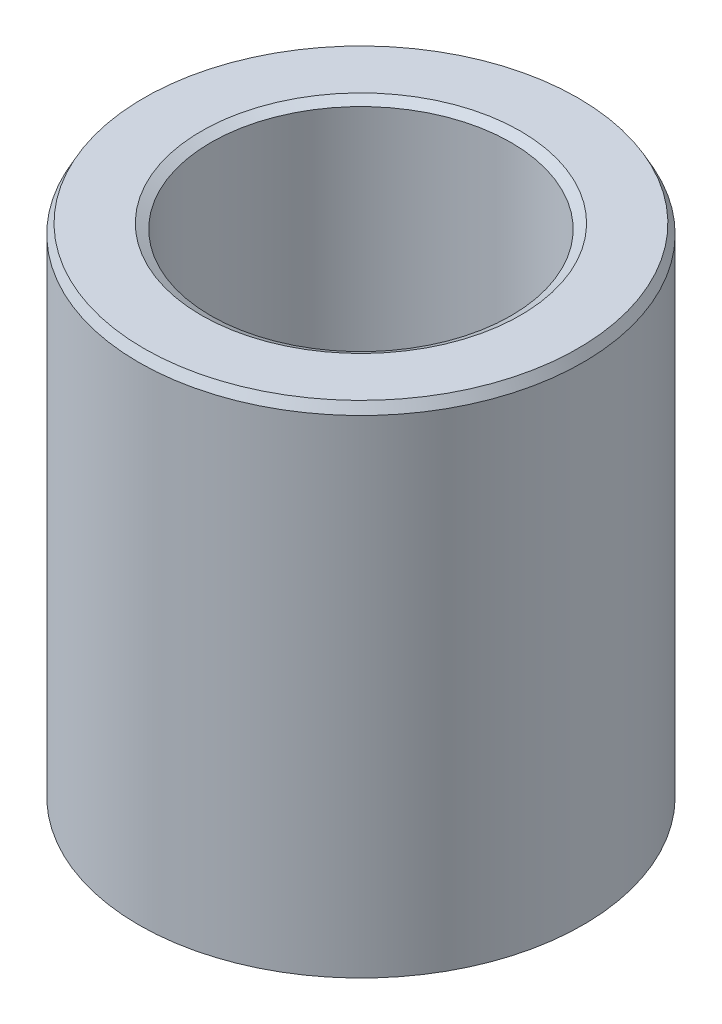
ISO-10303-21;
HEADER;
FILE_DESCRIPTION(('STEP AP214'),'2;1');
FILE_NAME('part.step','',(''),(''),'','','');
FILE_SCHEMA(('AUTOMOTIVE_DESIGN { 1 0 10303 214 1 1 1 1 }'));
ENDSEC;
DATA;
#1=APPLICATION_CONTEXT('core data for automotive mechanical design processes');
#2=APPLICATION_PROTOCOL_DEFINITION('international standard','automotive_design',2000,#1);
#3=PRODUCT_CONTEXT('',#1,'mechanical');
#4=PRODUCT('Part','Part','',(#3));
#5=PRODUCT_RELATED_PRODUCT_CATEGORY('part','',(#4));
#6=PRODUCT_DEFINITION_FORMATION('','',#4);
#7=PRODUCT_DEFINITION_CONTEXT('part definition',#1,'design');
#8=PRODUCT_DEFINITION('design','',#6,#7);
#9=PRODUCT_DEFINITION_SHAPE('','',#8);
#10=(LENGTH_UNIT() NAMED_UNIT(*) SI_UNIT(.MILLI.,.METRE.));
#11=(NAMED_UNIT(*) PLANE_ANGLE_UNIT() SI_UNIT($,.RADIAN.));
#12=(NAMED_UNIT(*) SI_UNIT($,.STERADIAN.) SOLID_ANGLE_UNIT());
#13=UNCERTAINTY_MEASURE_WITH_UNIT(LENGTH_MEASURE(1.E-05),#10,'distance_accuracy_value','');
#14=(GEOMETRIC_REPRESENTATION_CONTEXT(3) GLOBAL_UNCERTAINTY_ASSIGNED_CONTEXT((#13)) GLOBAL_UNIT_ASSIGNED_CONTEXT((#10,
#11,#12)) REPRESENTATION_CONTEXT('',''));
#15=CARTESIAN_POINT('',(0.,0.,0.));
#16=DIRECTION('',(0.,0.,1.));
#17=DIRECTION('',(1.,0.,0.));
#18=AXIS2_PLACEMENT_3D('',#15,#16,#17);
#19=CARTESIAN_POINT('',(0.,129.854006340041,0.));
#20=DIRECTION('',(0.,-1.,0.));
#21=DIRECTION('',(0.,0.,-1.));
#22=AXIS2_PLACEMENT_3D('',#19,#20,#21);
#23=CYLINDRICAL_SURFACE('',#22,57.5);
#24=CARTESIAN_POINT('',(0.,1.32755254608749,0.));
#25=DIRECTION('',(0.,1.,0.));
#26=DIRECTION('',(0.,0.,1.));
#27=AXIS2_PLACEMENT_3D('',#24,#25,#26);
#28=CIRCLE('',#27,57.5);
#29=CARTESIAN_POINT('',(0.,1.32755254608749,57.5));
#30=VERTEX_POINT('',#29);
#31=EDGE_CURVE('E10',#30,#30,#28,.T.);
#32=ORIENTED_EDGE('',*,*,#31,.T.);
#33=EDGE_LOOP('',(#32));
#34=FACE_BOUND('',#33,.T.);
#35=CARTESIAN_POINT('',(0.,127.402297248475,0.));
#36=DIRECTION('',(0.,1.,0.));
#37=DIRECTION('',(0.,0.,1.));
#38=AXIS2_PLACEMENT_3D('',#35,#36,#37);
#39=CIRCLE('',#38,57.5);
#40=CARTESIAN_POINT('',(0.,127.402297248475,57.5));
#41=VERTEX_POINT('',#40);
#42=EDGE_CURVE('E50',#41,#41,#39,.F.);
#43=ORIENTED_EDGE('',*,*,#42,.T.);
#44=EDGE_LOOP('',(#43));
#45=FACE_BOUND('',#44,.T.);
#46=ADVANCED_FACE('F39',(#34,#45),#23,.T.);
#47=CARTESIAN_POINT('',(0.,129.854006340041,0.));
#48=DIRECTION('',(0.,1.,0.));
#49=DIRECTION('',(0.,0.,1.));
#50=AXIS2_PLACEMENT_3D('',#47,#48,#49);
#51=PLANE('',#50);
#52=CARTESIAN_POINT('',(0.,129.854006340041,0.));
#53=DIRECTION('',(0.,1.,0.));
#54=DIRECTION('',(0.,0.,1.));
#55=AXIS2_PLACEMENT_3D('',#52,#53,#54);
#56=CIRCLE('',#55,41.293597036373);
#57=CARTESIAN_POINT('',(0.,129.854006340041,41.293597036373));
#58=VERTEX_POINT('',#57);
#59=EDGE_CURVE('E58',#58,#58,#56,.F.);
#60=ORIENTED_EDGE('',*,*,#59,.T.);
#61=EDGE_LOOP('',(#60));
#62=FACE_BOUND('',#61,.T.);
#63=CARTESIAN_POINT('',(0.,129.854006340041,0.));
#64=DIRECTION('',(0.,1.,0.));
#65=DIRECTION('',(0.,0.,1.));
#66=AXIS2_PLACEMENT_3D('',#63,#64,#65);
#67=CIRCLE('',#66,56.1724474539125);
#68=CARTESIAN_POINT('',(0.,129.854006340041,56.1724474539125));
#69=VERTEX_POINT('',#68);
#70=EDGE_CURVE('E61',#69,#69,#67,.T.);
#71=ORIENTED_EDGE('',*,*,#70,.T.);
#72=EDGE_LOOP('',(#71));
#73=FACE_BOUND('',#72,.T.);
#74=ADVANCED_FACE('F88',(#62,#73),#51,.T.);
#75=CARTESIAN_POINT('',(0.,0.,0.));
#76=DIRECTION('',(0.,1.,0.));
#77=DIRECTION('',(0.,0.,1.));
#78=AXIS2_PLACEMENT_3D('',#75,#76,#77);
#79=PLANE('',#78);
#80=CARTESIAN_POINT('',(0.,0.,0.));
#81=DIRECTION('',(0.,1.,0.));
#82=DIRECTION('',(0.,0.,1.));
#83=AXIS2_PLACEMENT_3D('',#80,#81,#82);
#84=CIRCLE('',#83,40.1694404908948);
#85=CARTESIAN_POINT('',(0.,0.,40.1694404908948));
#86=VERTEX_POINT('',#85);
#87=EDGE_CURVE('E51',#86,#86,#84,.T.);
#88=ORIENTED_EDGE('',*,*,#87,.T.);
#89=EDGE_LOOP('',(#88));
#90=FACE_BOUND('',#89,.T.);
#91=CARTESIAN_POINT('',(0.,0.,0.));
#92=DIRECTION('',(0.,1.,0.));
#93=DIRECTION('',(0.,0.,1.));
#94=AXIS2_PLACEMENT_3D('',#91,#92,#93);
#95=CIRCLE('',#94,55.0482909084343);
#96=CARTESIAN_POINT('',(0.,0.,55.0482909084343));
#97=VERTEX_POINT('',#96);
#98=EDGE_CURVE('E54',#97,#97,#95,.F.);
#99=ORIENTED_EDGE('',*,*,#98,.T.);
#100=EDGE_LOOP('',(#99));
#101=FACE_BOUND('',#100,.T.);
#102=ADVANCED_FACE('F83',(#90,#101),#79,.F.);
#103=CARTESIAN_POINT('',(0.,129.854006340041,0.));
#104=DIRECTION('',(0.,-1.,0.));
#105=DIRECTION('',(0.,0.,-1.));
#106=AXIS2_PLACEMENT_3D('',#103,#104,#105);
#107=CYLINDRICAL_SURFACE('',#106,38.8418879448073);
#108=CARTESIAN_POINT('',(0.,128.526453793953,0.));
#109=DIRECTION('',(0.,1.,0.));
#110=DIRECTION('',(0.,0.,1.));
#111=AXIS2_PLACEMENT_3D('',#108,#109,#110);
#112=CIRCLE('',#111,38.8418879448073);
#113=CARTESIAN_POINT('',(0.,128.526453793953,38.8418879448073));
#114=VERTEX_POINT('',#113);
#115=EDGE_CURVE('E67',#114,#114,#112,.T.);
#116=ORIENTED_EDGE('',*,*,#115,.T.);
#117=EDGE_LOOP('',(#116));
#118=FACE_BOUND('',#117,.T.);
#119=CARTESIAN_POINT('',(0.,2.45170909156572,0.));
#120=DIRECTION('',(0.,1.,0.));
#121=DIRECTION('',(0.,0.,1.));
#122=AXIS2_PLACEMENT_3D('',#119,#120,#121);
#123=CIRCLE('',#122,38.8418879448073);
#124=CARTESIAN_POINT('',(0.,2.45170909156572,38.8418879448073));
#125=VERTEX_POINT('',#124);
#126=EDGE_CURVE('E69',#125,#125,#123,.F.);
#127=ORIENTED_EDGE('',*,*,#126,.T.);
#128=EDGE_LOOP('',(#127));
#129=FACE_BOUND('',#128,.T.);
#130=ADVANCED_FACE('F71',(#118,#129),#107,.F.);
#131=CARTESIAN_POINT('',(0.,128.526453793953,0.));
#132=DIRECTION('',(0.,1.,0.));
#133=DIRECTION('',(0.,0.,1.));
#134=AXIS2_PLACEMENT_3D('',#131,#132,#133);
#135=CONICAL_SURFACE('',#134,38.8418879448073,1.07451755761051);
#136=ORIENTED_EDGE('',*,*,#59,.F.);
#137=EDGE_LOOP('',(#136));
#138=FACE_BOUND('',#137,.T.);
#139=ORIENTED_EDGE('',*,*,#115,.F.);
#140=EDGE_LOOP('',(#139));
#141=FACE_BOUND('',#140,.T.);
#142=ADVANCED_FACE('F77',(#138,#141),#135,.F.);
#143=CARTESIAN_POINT('',(0.,0.,0.));
#144=DIRECTION('',(0.,-1.,0.));
#145=DIRECTION('',(0.,0.,-1.));
#146=AXIS2_PLACEMENT_3D('',#143,#144,#145);
#147=CONICAL_SURFACE('',#146,40.1694404908948,0.496278769184386);
#148=ORIENTED_EDGE('',*,*,#126,.F.);
#149=EDGE_LOOP('',(#148));
#150=FACE_BOUND('',#149,.T.);
#151=ORIENTED_EDGE('',*,*,#87,.F.);
#152=EDGE_LOOP('',(#151));
#153=FACE_BOUND('',#152,.T.);
#154=ADVANCED_FACE('F73',(#150,#153),#147,.F.);
#155=CARTESIAN_POINT('',(0.,1.32755254608749,0.));
#156=DIRECTION('',(0.,1.,0.));
#157=DIRECTION('',(0.,0.,1.));
#158=AXIS2_PLACEMENT_3D('',#155,#156,#157);
#159=CONICAL_SURFACE('',#158,57.5,1.07451755761051);
#160=ORIENTED_EDGE('',*,*,#98,.F.);
#161=EDGE_LOOP('',(#160));
#162=FACE_BOUND('',#161,.T.);
#163=ORIENTED_EDGE('',*,*,#31,.F.);
#164=EDGE_LOOP('',(#163));
#165=FACE_BOUND('',#164,.T.);
#166=ADVANCED_FACE('F76',(#162,#165),#159,.T.);
#167=CARTESIAN_POINT('',(0.,129.854006340041,0.));
#168=DIRECTION('',(0.,-1.,0.));
#169=DIRECTION('',(0.,0.,-1.));
#170=AXIS2_PLACEMENT_3D('',#167,#168,#169);
#171=CONICAL_SURFACE('',#170,56.1724474539125,0.496278769184376);
#172=ORIENTED_EDGE('',*,*,#42,.F.);
#173=EDGE_LOOP('',(#172));
#174=FACE_BOUND('',#173,.T.);
#175=ORIENTED_EDGE('',*,*,#70,.F.);
#176=EDGE_LOOP('',(#175));
#177=FACE_BOUND('',#176,.T.);
#178=ADVANCED_FACE('F45',(#174,#177),#171,.T.);
#179=CLOSED_SHELL('',(#46,#74,#102,#130,#142,#154,#166,#178));
#180=MANIFOLD_SOLID_BREP('B2',#179);
#181=ADVANCED_BREP_SHAPE_REPRESENTATION('',(#18,#180),#14);
#182=SHAPE_DEFINITION_REPRESENTATION(#9,#181);
ENDSEC;
END-ISO-10303-21;
